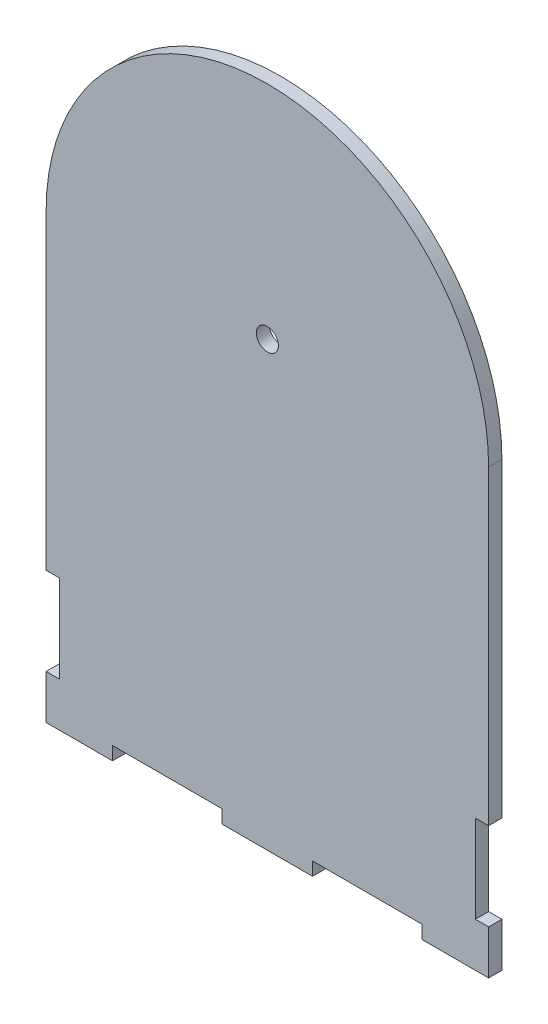
ISO-10303-21;
HEADER;
FILE_DESCRIPTION(('STEP AP214'),'2;1');
FILE_NAME('part.step','',(''),(''),'','','');
FILE_SCHEMA(('AUTOMOTIVE_DESIGN { 1 0 10303 214 1 1 1 1 }'));
ENDSEC;
DATA;
#1=APPLICATION_CONTEXT('core data for automotive mechanical design processes');
#2=APPLICATION_PROTOCOL_DEFINITION('international standard','automotive_design',2000,#1);
#3=PRODUCT_CONTEXT('',#1,'mechanical');
#4=PRODUCT('Part','Part','',(#3));
#5=PRODUCT_RELATED_PRODUCT_CATEGORY('part','',(#4));
#6=PRODUCT_DEFINITION_FORMATION('','',#4);
#7=PRODUCT_DEFINITION_CONTEXT('part definition',#1,'design');
#8=PRODUCT_DEFINITION('design','',#6,#7);
#9=PRODUCT_DEFINITION_SHAPE('','',#8);
#10=(LENGTH_UNIT() NAMED_UNIT(*) SI_UNIT(.MILLI.,.METRE.));
#11=(NAMED_UNIT(*) PLANE_ANGLE_UNIT() SI_UNIT($,.RADIAN.));
#12=(NAMED_UNIT(*) SI_UNIT($,.STERADIAN.) SOLID_ANGLE_UNIT());
#13=UNCERTAINTY_MEASURE_WITH_UNIT(LENGTH_MEASURE(1.E-05),#10,'distance_accuracy_value','');
#14=(GEOMETRIC_REPRESENTATION_CONTEXT(3) GLOBAL_UNCERTAINTY_ASSIGNED_CONTEXT((#13)) GLOBAL_UNIT_ASSIGNED_CONTEXT((#10,
#11,#12)) REPRESENTATION_CONTEXT('',''));
#15=CARTESIAN_POINT('',(0.,0.,0.));
#16=DIRECTION('',(0.,0.,1.));
#17=DIRECTION('',(1.,0.,0.));
#18=AXIS2_PLACEMENT_3D('',#15,#16,#17);
#19=CARTESIAN_POINT('',(50.,100.,3.));
#20=DIRECTION('',(0.,0.,-1.));
#21=DIRECTION('',(-1.,0.,0.));
#22=AXIS2_PLACEMENT_3D('',#19,#20,#21);
#23=CYLINDRICAL_SURFACE('',#22,50.);
#24=CARTESIAN_POINT('',(50.,100.,0.));
#25=DIRECTION('',(0.,0.,1.));
#26=DIRECTION('',(1.,0.,0.));
#27=AXIS2_PLACEMENT_3D('',#24,#25,#26);
#28=CIRCLE('',#27,50.);
#29=CARTESIAN_POINT('',(100.,100.,0.));
#30=VERTEX_POINT('',#29);
#31=CARTESIAN_POINT('',(0.,100.,0.));
#32=VERTEX_POINT('',#31);
#33=EDGE_CURVE('E206',#30,#32,#28,.T.);
#34=ORIENTED_EDGE('',*,*,#33,.T.);
#35=DIRECTION('',(0.,0.,-1.));
#36=VECTOR('',#35,1.);
#37=CARTESIAN_POINT('',(0.,100.,3.));
#38=LINE('',#37,#36);
#39=CARTESIAN_POINT('',(0.,100.,3.));
#40=VERTEX_POINT('',#39);
#41=EDGE_CURVE('E11',#40,#32,#38,.T.);
#42=ORIENTED_EDGE('',*,*,#41,.F.);
#43=CARTESIAN_POINT('',(50.,100.,3.));
#44=DIRECTION('',(0.,0.,1.));
#45=DIRECTION('',(1.,0.,0.));
#46=AXIS2_PLACEMENT_3D('',#43,#44,#45);
#47=CIRCLE('',#46,50.);
#48=CARTESIAN_POINT('',(100.,100.,3.));
#49=VERTEX_POINT('',#48);
#50=EDGE_CURVE('E125',#49,#40,#47,.T.);
#51=ORIENTED_EDGE('',*,*,#50,.F.);
#52=DIRECTION('',(0.,0.,-1.));
#53=VECTOR('',#52,1.);
#54=CARTESIAN_POINT('',(100.,100.,3.));
#55=LINE('',#54,#53);
#56=EDGE_CURVE('E198',#49,#30,#55,.T.);
#57=ORIENTED_EDGE('',*,*,#56,.T.);
#58=EDGE_LOOP('',(#34,#42,#51,#57));
#59=FACE_BOUND('',#58,.T.);
#60=ADVANCED_FACE('F36',(#59),#23,.T.);
#61=CARTESIAN_POINT('',(0.,0.,3.));
#62=DIRECTION('',(-1.,0.,0.));
#63=DIRECTION('',(0.,-1.,0.));
#64=AXIS2_PLACEMENT_3D('',#61,#62,#63);
#65=PLANE('',#64);
#66=DIRECTION('',(0.,1.,0.));
#67=VECTOR('',#66,1.);
#68=CARTESIAN_POINT('',(0.,0.,0.));
#69=LINE('',#68,#67);
#70=CARTESIAN_POINT('',(0.,29.8,0.));
#71=VERTEX_POINT('',#70);
#72=EDGE_CURVE('E209',#71,#32,#69,.T.);
#73=ORIENTED_EDGE('',*,*,#72,.F.);
#74=DIRECTION('',(0.,0.,-1.));
#75=VECTOR('',#74,1.);
#76=CARTESIAN_POINT('',(0.,29.8,3.));
#77=LINE('',#76,#75);
#78=CARTESIAN_POINT('',(0.,29.8,3.));
#79=VERTEX_POINT('',#78);
#80=EDGE_CURVE('E45',#79,#71,#77,.T.);
#81=ORIENTED_EDGE('',*,*,#80,.F.);
#82=DIRECTION('',(0.,1.,0.));
#83=VECTOR('',#82,1.);
#84=CARTESIAN_POINT('',(0.,0.,3.));
#85=LINE('',#84,#83);
#86=EDGE_CURVE('E301',#79,#40,#85,.T.);
#87=ORIENTED_EDGE('',*,*,#86,.T.);
#88=ORIENTED_EDGE('',*,*,#41,.T.);
#89=EDGE_LOOP('',(#73,#81,#87,#88));
#90=FACE_BOUND('',#89,.T.);
#91=ADVANCED_FACE('F300',(#90),#65,.T.);
#92=CARTESIAN_POINT('',(0.,29.8,3.));
#93=DIRECTION('',(0.,1.,0.));
#94=DIRECTION('',(0.,0.,1.));
#95=AXIS2_PLACEMENT_3D('',#92,#93,#94);
#96=PLANE('',#95);
#97=DIRECTION('',(1.,0.,0.));
#98=VECTOR('',#97,1.);
#99=CARTESIAN_POINT('',(0.,29.8,0.));
#100=LINE('',#99,#98);
#101=CARTESIAN_POINT('',(3.00000000000002,29.8,0.));
#102=VERTEX_POINT('',#101);
#103=EDGE_CURVE('E212',#71,#102,#100,.T.);
#104=ORIENTED_EDGE('',*,*,#103,.T.);
#105=DIRECTION('',(0.,0.,-1.));
#106=VECTOR('',#105,1.);
#107=CARTESIAN_POINT('',(3.00000000000002,29.8,3.));
#108=LINE('',#107,#106);
#109=CARTESIAN_POINT('',(3.00000000000002,29.8,3.));
#110=VERTEX_POINT('',#109);
#111=EDGE_CURVE('E285',#110,#102,#108,.T.);
#112=ORIENTED_EDGE('',*,*,#111,.F.);
#113=DIRECTION('',(1.,0.,0.));
#114=VECTOR('',#113,1.);
#115=CARTESIAN_POINT('',(0.,29.8,3.));
#116=LINE('',#115,#114);
#117=EDGE_CURVE('E292',#79,#110,#116,.T.);
#118=ORIENTED_EDGE('',*,*,#117,.F.);
#119=ORIENTED_EDGE('',*,*,#80,.T.);
#120=EDGE_LOOP('',(#104,#112,#118,#119));
#121=FACE_BOUND('',#120,.T.);
#122=ADVANCED_FACE('F290',(#121),#96,.F.);
#123=CARTESIAN_POINT('',(3.00000000000091,0.,3.));
#124=DIRECTION('',(1.,0.,0.));
#125=DIRECTION('',(0.,1.,0.));
#126=AXIS2_PLACEMENT_3D('',#123,#124,#125);
#127=PLANE('',#126);
#128=DIRECTION('',(0.,-1.,0.));
#129=VECTOR('',#128,1.);
#130=CARTESIAN_POINT('',(3.00000000000091,0.,0.));
#131=LINE('',#130,#129);
#132=CARTESIAN_POINT('',(3.00000000000061,9.99999999999978,0.));
#133=VERTEX_POINT('',#132);
#134=EDGE_CURVE('E215',#102,#133,#131,.T.);
#135=ORIENTED_EDGE('',*,*,#134,.T.);
#136=DIRECTION('',(0.,0.,-1.));
#137=VECTOR('',#136,1.);
#138=CARTESIAN_POINT('',(3.00000000000061,9.99999999999978,3.));
#139=LINE('',#138,#137);
#140=CARTESIAN_POINT('',(3.00000000000061,9.99999999999978,3.));
#141=VERTEX_POINT('',#140);
#142=EDGE_CURVE('E283',#141,#133,#139,.T.);
#143=ORIENTED_EDGE('',*,*,#142,.F.);
#144=DIRECTION('',(0.,-1.,0.));
#145=VECTOR('',#144,1.);
#146=CARTESIAN_POINT('',(3.00000000000091,0.,3.));
#147=LINE('',#146,#145);
#148=EDGE_CURVE('E313',#110,#141,#147,.T.);
#149=ORIENTED_EDGE('',*,*,#148,.F.);
#150=ORIENTED_EDGE('',*,*,#111,.T.);
#151=EDGE_LOOP('',(#135,#143,#149,#150));
#152=FACE_BOUND('',#151,.T.);
#153=ADVANCED_FACE('F400',(#152),#127,.F.);
#154=CARTESIAN_POINT('',(-7.40148683083404E-13,9.99999999999956,3.));
#155=DIRECTION('',(0.,1.,0.));
#156=DIRECTION('',(-1.,0.,0.));
#157=AXIS2_PLACEMENT_3D('',#154,#155,#156);
#158=PLANE('',#157);
#159=DIRECTION('',(1.,0.,0.));
#160=VECTOR('',#159,1.);
#161=CARTESIAN_POINT('',(-7.40148683083404E-13,9.99999999999956,0.));
#162=LINE('',#161,#160);
#163=CARTESIAN_POINT('',(0.,9.99999999999967,0.));
#164=VERTEX_POINT('',#163);
#165=EDGE_CURVE('E218',#164,#133,#162,.T.);
#166=ORIENTED_EDGE('',*,*,#165,.F.);
#167=DIRECTION('',(0.,0.,-1.));
#168=VECTOR('',#167,1.);
#169=CARTESIAN_POINT('',(0.,9.99999999999967,3.));
#170=LINE('',#169,#168);
#171=CARTESIAN_POINT('',(0.,9.99999999999967,3.));
#172=VERTEX_POINT('',#171);
#173=EDGE_CURVE('E281',#172,#164,#170,.T.);
#174=ORIENTED_EDGE('',*,*,#173,.F.);
#175=DIRECTION('',(1.,0.,0.));
#176=VECTOR('',#175,1.);
#177=CARTESIAN_POINT('',(-7.40148683083404E-13,9.99999999999956,3.));
#178=LINE('',#177,#176);
#179=EDGE_CURVE('E315',#172,#141,#178,.T.);
#180=ORIENTED_EDGE('',*,*,#179,.T.);
#181=ORIENTED_EDGE('',*,*,#142,.T.);
#182=EDGE_LOOP('',(#166,#174,#180,#181));
#183=FACE_BOUND('',#182,.T.);
#184=ADVANCED_FACE('F396',(#183),#158,.T.);
#185=CARTESIAN_POINT('',(0.,0.,0.));
#186=VERTEX_POINT('',#185);
#187=EDGE_CURVE('E213',#186,#164,#69,.T.);
#188=ORIENTED_EDGE('',*,*,#187,.F.);
#189=DIRECTION('',(0.,0.,-1.));
#190=VECTOR('',#189,1.);
#191=CARTESIAN_POINT('',(0.,0.,3.));
#192=LINE('',#191,#190);
#193=CARTESIAN_POINT('',(0.,0.,3.));
#194=VERTEX_POINT('',#193);
#195=EDGE_CURVE('E279',#194,#186,#192,.T.);
#196=ORIENTED_EDGE('',*,*,#195,.F.);
#197=EDGE_CURVE('E311',#194,#172,#85,.T.);
#198=ORIENTED_EDGE('',*,*,#197,.T.);
#199=ORIENTED_EDGE('',*,*,#173,.T.);
#200=EDGE_LOOP('',(#188,#196,#198,#199));
#201=FACE_BOUND('',#200,.T.);
#202=ADVANCED_FACE('F391',(#201),#65,.T.);
#203=CARTESIAN_POINT('',(0.,0.,3.));
#204=DIRECTION('',(0.,1.,0.));
#205=DIRECTION('',(0.,0.,1.));
#206=AXIS2_PLACEMENT_3D('',#203,#204,#205);
#207=PLANE('',#206);
#208=DIRECTION('',(1.,0.,0.));
#209=VECTOR('',#208,1.);
#210=CARTESIAN_POINT('',(0.,0.,0.));
#211=LINE('',#210,#209);
#212=CARTESIAN_POINT('',(15.,0.,0.));
#213=VERTEX_POINT('',#212);
#214=EDGE_CURVE('E221',#186,#213,#211,.T.);
#215=ORIENTED_EDGE('',*,*,#214,.T.);
#216=DIRECTION('',(0.,0.,-1.));
#217=VECTOR('',#216,1.);
#218=CARTESIAN_POINT('',(15.,0.,3.));
#219=LINE('',#218,#217);
#220=CARTESIAN_POINT('',(15.,0.,3.));
#221=VERTEX_POINT('',#220);
#222=EDGE_CURVE('E276',#221,#213,#219,.T.);
#223=ORIENTED_EDGE('',*,*,#222,.F.);
#224=DIRECTION('',(1.,0.,0.));
#225=VECTOR('',#224,1.);
#226=CARTESIAN_POINT('',(0.,0.,3.));
#227=LINE('',#226,#225);
#228=EDGE_CURVE('E318',#194,#221,#227,.T.);
#229=ORIENTED_EDGE('',*,*,#228,.F.);
#230=ORIENTED_EDGE('',*,*,#195,.T.);
#231=EDGE_LOOP('',(#215,#223,#229,#230));
#232=FACE_BOUND('',#231,.T.);
#233=ADVANCED_FACE('F386',(#232),#207,.F.);
#234=CARTESIAN_POINT('',(15.,0.,3.));
#235=DIRECTION('',(-1.,0.,0.));
#236=DIRECTION('',(0.,0.,1.));
#237=AXIS2_PLACEMENT_3D('',#234,#235,#236);
#238=PLANE('',#237);
#239=DIRECTION('',(0.,1.,0.));
#240=VECTOR('',#239,1.);
#241=CARTESIAN_POINT('',(15.,0.,0.));
#242=LINE('',#241,#240);
#243=CARTESIAN_POINT('',(15.,3.,0.));
#244=VERTEX_POINT('',#243);
#245=EDGE_CURVE('E223',#213,#244,#242,.T.);
#246=ORIENTED_EDGE('',*,*,#245,.T.);
#247=DIRECTION('',(0.,0.,-1.));
#248=VECTOR('',#247,1.);
#249=CARTESIAN_POINT('',(15.,3.,3.));
#250=LINE('',#249,#248);
#251=CARTESIAN_POINT('',(15.,3.,3.));
#252=VERTEX_POINT('',#251);
#253=EDGE_CURVE('E273',#252,#244,#250,.T.);
#254=ORIENTED_EDGE('',*,*,#253,.F.);
#255=DIRECTION('',(0.,1.,0.));
#256=VECTOR('',#255,1.);
#257=CARTESIAN_POINT('',(15.,0.,3.));
#258=LINE('',#257,#256);
#259=EDGE_CURVE('E320',#221,#252,#258,.T.);
#260=ORIENTED_EDGE('',*,*,#259,.F.);
#261=ORIENTED_EDGE('',*,*,#222,.T.);
#262=EDGE_LOOP('',(#246,#254,#260,#261));
#263=FACE_BOUND('',#262,.T.);
#264=ADVANCED_FACE('F382',(#263),#238,.F.);
#265=CARTESIAN_POINT('',(0.,3.,3.));
#266=DIRECTION('',(0.,1.,0.));
#267=DIRECTION('',(0.,0.,1.));
#268=AXIS2_PLACEMENT_3D('',#265,#266,#267);
#269=PLANE('',#268);
#270=DIRECTION('',(1.,0.,0.));
#271=VECTOR('',#270,1.);
#272=CARTESIAN_POINT('',(0.,3.,0.));
#273=LINE('',#272,#271);
#274=CARTESIAN_POINT('',(39.8,3.,0.));
#275=VERTEX_POINT('',#274);
#276=EDGE_CURVE('E225',#244,#275,#273,.T.);
#277=ORIENTED_EDGE('',*,*,#276,.T.);
#278=DIRECTION('',(0.,0.,-1.));
#279=VECTOR('',#278,1.);
#280=CARTESIAN_POINT('',(39.8,3.,3.));
#281=LINE('',#280,#279);
#282=CARTESIAN_POINT('',(39.8,3.,3.));
#283=VERTEX_POINT('',#282);
#284=EDGE_CURVE('E271',#283,#275,#281,.T.);
#285=ORIENTED_EDGE('',*,*,#284,.F.);
#286=DIRECTION('',(1.,0.,0.));
#287=VECTOR('',#286,1.);
#288=CARTESIAN_POINT('',(0.,3.,3.));
#289=LINE('',#288,#287);
#290=EDGE_CURVE('E322',#252,#283,#289,.T.);
#291=ORIENTED_EDGE('',*,*,#290,.F.);
#292=ORIENTED_EDGE('',*,*,#253,.T.);
#293=EDGE_LOOP('',(#277,#285,#291,#292));
#294=FACE_BOUND('',#293,.T.);
#295=ADVANCED_FACE('F377',(#294),#269,.F.);
#296=CARTESIAN_POINT('',(39.8,0.,3.));
#297=DIRECTION('',(-1.,0.,0.));
#298=DIRECTION('',(0.,0.,1.));
#299=AXIS2_PLACEMENT_3D('',#296,#297,#298);
#300=PLANE('',#299);
#301=DIRECTION('',(0.,1.,0.));
#302=VECTOR('',#301,1.);
#303=CARTESIAN_POINT('',(39.8,0.,0.));
#304=LINE('',#303,#302);
#305=CARTESIAN_POINT('',(39.8,0.,0.));
#306=VERTEX_POINT('',#305);
#307=EDGE_CURVE('E228',#306,#275,#304,.T.);
#308=ORIENTED_EDGE('',*,*,#307,.F.);
#309=DIRECTION('',(0.,0.,-1.));
#310=VECTOR('',#309,1.);
#311=CARTESIAN_POINT('',(39.8,0.,3.));
#312=LINE('',#311,#310);
#313=CARTESIAN_POINT('',(39.8,0.,3.));
#314=VERTEX_POINT('',#313);
#315=EDGE_CURVE('E269',#314,#306,#312,.T.);
#316=ORIENTED_EDGE('',*,*,#315,.F.);
#317=DIRECTION('',(0.,1.,0.));
#318=VECTOR('',#317,1.);
#319=CARTESIAN_POINT('',(39.8,0.,3.));
#320=LINE('',#319,#318);
#321=EDGE_CURVE('E324',#314,#283,#320,.T.);
#322=ORIENTED_EDGE('',*,*,#321,.T.);
#323=ORIENTED_EDGE('',*,*,#284,.T.);
#324=EDGE_LOOP('',(#308,#316,#322,#323));
#325=FACE_BOUND('',#324,.T.);
#326=ADVANCED_FACE('F371',(#325),#300,.T.);
#327=CARTESIAN_POINT('',(0.,0.,3.));
#328=DIRECTION('',(0.,1.,0.));
#329=DIRECTION('',(0.,0.,1.));
#330=AXIS2_PLACEMENT_3D('',#327,#328,#329);
#331=PLANE('',#330);
#332=DIRECTION('',(1.,0.,0.));
#333=VECTOR('',#332,1.);
#334=CARTESIAN_POINT('',(0.,0.,0.));
#335=LINE('',#334,#333);
#336=CARTESIAN_POINT('',(60.2,0.,0.));
#337=VERTEX_POINT('',#336);
#338=EDGE_CURVE('E231',#306,#337,#335,.T.);
#339=ORIENTED_EDGE('',*,*,#338,.T.);
#340=DIRECTION('',(0.,0.,-1.));
#341=VECTOR('',#340,1.);
#342=CARTESIAN_POINT('',(60.2,0.,3.));
#343=LINE('',#342,#341);
#344=CARTESIAN_POINT('',(60.2,0.,3.));
#345=VERTEX_POINT('',#344);
#346=EDGE_CURVE('E266',#345,#337,#343,.T.);
#347=ORIENTED_EDGE('',*,*,#346,.F.);
#348=DIRECTION('',(1.,0.,0.));
#349=VECTOR('',#348,1.);
#350=CARTESIAN_POINT('',(0.,0.,3.));
#351=LINE('',#350,#349);
#352=EDGE_CURVE('E327',#314,#345,#351,.T.);
#353=ORIENTED_EDGE('',*,*,#352,.F.);
#354=ORIENTED_EDGE('',*,*,#315,.T.);
#355=EDGE_LOOP('',(#339,#347,#353,#354));
#356=FACE_BOUND('',#355,.T.);
#357=ADVANCED_FACE('F368',(#356),#331,.F.);
#358=CARTESIAN_POINT('',(60.2,0.,3.));
#359=DIRECTION('',(-1.,0.,0.));
#360=DIRECTION('',(0.,0.,1.));
#361=AXIS2_PLACEMENT_3D('',#358,#359,#360);
#362=PLANE('',#361);
#363=DIRECTION('',(0.,1.,0.));
#364=VECTOR('',#363,1.);
#365=CARTESIAN_POINT('',(60.2,0.,0.));
#366=LINE('',#365,#364);
#367=CARTESIAN_POINT('',(60.2,3.,0.));
#368=VERTEX_POINT('',#367);
#369=EDGE_CURVE('E233',#337,#368,#366,.T.);
#370=ORIENTED_EDGE('',*,*,#369,.T.);
#371=DIRECTION('',(0.,0.,-1.));
#372=VECTOR('',#371,1.);
#373=CARTESIAN_POINT('',(60.2,3.,3.));
#374=LINE('',#373,#372);
#375=CARTESIAN_POINT('',(60.2,3.,3.));
#376=VERTEX_POINT('',#375);
#377=EDGE_CURVE('E263',#376,#368,#374,.T.);
#378=ORIENTED_EDGE('',*,*,#377,.F.);
#379=DIRECTION('',(0.,1.,0.));
#380=VECTOR('',#379,1.);
#381=CARTESIAN_POINT('',(60.2,0.,3.));
#382=LINE('',#381,#380);
#383=EDGE_CURVE('E329',#345,#376,#382,.T.);
#384=ORIENTED_EDGE('',*,*,#383,.F.);
#385=ORIENTED_EDGE('',*,*,#346,.T.);
#386=EDGE_LOOP('',(#370,#378,#384,#385));
#387=FACE_BOUND('',#386,.T.);
#388=ADVANCED_FACE('F363',(#387),#362,.F.);
#389=CARTESIAN_POINT('',(0.,3.,3.));
#390=DIRECTION('',(0.,1.,0.));
#391=DIRECTION('',(0.,0.,1.));
#392=AXIS2_PLACEMENT_3D('',#389,#390,#391);
#393=PLANE('',#392);
#394=DIRECTION('',(1.,0.,0.));
#395=VECTOR('',#394,1.);
#396=CARTESIAN_POINT('',(0.,3.,0.));
#397=LINE('',#396,#395);
#398=CARTESIAN_POINT('',(85.,3.,0.));
#399=VERTEX_POINT('',#398);
#400=EDGE_CURVE('E236',#368,#399,#397,.T.);
#401=ORIENTED_EDGE('',*,*,#400,.T.);
#402=DIRECTION('',(0.,0.,-1.));
#403=VECTOR('',#402,1.);
#404=CARTESIAN_POINT('',(85.,3.,3.));
#405=LINE('',#404,#403);
#406=CARTESIAN_POINT('',(85.,3.,3.));
#407=VERTEX_POINT('',#406);
#408=EDGE_CURVE('E261',#407,#399,#405,.T.);
#409=ORIENTED_EDGE('',*,*,#408,.F.);
#410=DIRECTION('',(1.,0.,0.));
#411=VECTOR('',#410,1.);
#412=CARTESIAN_POINT('',(0.,3.,3.));
#413=LINE('',#412,#411);
#414=EDGE_CURVE('E332',#376,#407,#413,.T.);
#415=ORIENTED_EDGE('',*,*,#414,.F.);
#416=ORIENTED_EDGE('',*,*,#377,.T.);
#417=EDGE_LOOP('',(#401,#409,#415,#416));
#418=FACE_BOUND('',#417,.T.);
#419=ADVANCED_FACE('F357',(#418),#393,.F.);
#420=CARTESIAN_POINT('',(85.,0.,3.));
#421=DIRECTION('',(-1.,0.,0.));
#422=DIRECTION('',(0.,0.,1.));
#423=AXIS2_PLACEMENT_3D('',#420,#421,#422);
#424=PLANE('',#423);
#425=DIRECTION('',(0.,1.,0.));
#426=VECTOR('',#425,1.);
#427=CARTESIAN_POINT('',(85.,0.,0.));
#428=LINE('',#427,#426);
#429=CARTESIAN_POINT('',(85.,0.,0.));
#430=VERTEX_POINT('',#429);
#431=EDGE_CURVE('E239',#430,#399,#428,.T.);
#432=ORIENTED_EDGE('',*,*,#431,.F.);
#433=DIRECTION('',(0.,0.,-1.));
#434=VECTOR('',#433,1.);
#435=CARTESIAN_POINT('',(85.,0.,3.));
#436=LINE('',#435,#434);
#437=CARTESIAN_POINT('',(85.,0.,3.));
#438=VERTEX_POINT('',#437);
#439=EDGE_CURVE('E259',#438,#430,#436,.T.);
#440=ORIENTED_EDGE('',*,*,#439,.F.);
#441=DIRECTION('',(0.,1.,0.));
#442=VECTOR('',#441,1.);
#443=CARTESIAN_POINT('',(85.,0.,3.));
#444=LINE('',#443,#442);
#445=EDGE_CURVE('E334',#438,#407,#444,.T.);
#446=ORIENTED_EDGE('',*,*,#445,.T.);
#447=ORIENTED_EDGE('',*,*,#408,.T.);
#448=EDGE_LOOP('',(#432,#440,#446,#447));
#449=FACE_BOUND('',#448,.T.);
#450=ADVANCED_FACE('F353',(#449),#424,.T.);
#451=CARTESIAN_POINT('',(100.,0.,0.));
#452=VERTEX_POINT('',#451);
#453=EDGE_CURVE('E234',#430,#452,#335,.T.);
#454=ORIENTED_EDGE('',*,*,#453,.T.);
#455=DIRECTION('',(0.,0.,-1.));
#456=VECTOR('',#455,1.);
#457=CARTESIAN_POINT('',(100.,0.,3.));
#458=LINE('',#457,#456);
#459=CARTESIAN_POINT('',(100.,0.,3.));
#460=VERTEX_POINT('',#459);
#461=EDGE_CURVE('E256',#460,#452,#458,.T.);
#462=ORIENTED_EDGE('',*,*,#461,.F.);
#463=EDGE_CURVE('E330',#438,#460,#351,.T.);
#464=ORIENTED_EDGE('',*,*,#463,.F.);
#465=ORIENTED_EDGE('',*,*,#439,.T.);
#466=EDGE_LOOP('',(#454,#462,#464,#465));
#467=FACE_BOUND('',#466,.T.);
#468=ADVANCED_FACE('F342',(#467),#331,.F.);
#469=CARTESIAN_POINT('',(100.,0.,3.));
#470=DIRECTION('',(-1.,0.,0.));
#471=DIRECTION('',(0.,-1.,0.));
#472=AXIS2_PLACEMENT_3D('',#469,#470,#471);
#473=PLANE('',#472);
#474=DIRECTION('',(0.,1.,0.));
#475=VECTOR('',#474,1.);
#476=CARTESIAN_POINT('',(100.,0.,0.));
#477=LINE('',#476,#475);
#478=CARTESIAN_POINT('',(100.,10.,0.));
#479=VERTEX_POINT('',#478);
#480=EDGE_CURVE('E242',#452,#479,#477,.T.);
#481=ORIENTED_EDGE('',*,*,#480,.T.);
#482=DIRECTION('',(0.,0.,-1.));
#483=VECTOR('',#482,1.);
#484=CARTESIAN_POINT('',(100.,10.,3.));
#485=LINE('',#484,#483);
#486=CARTESIAN_POINT('',(100.,10.,3.));
#487=VERTEX_POINT('',#486);
#488=EDGE_CURVE('E253',#487,#479,#485,.T.);
#489=ORIENTED_EDGE('',*,*,#488,.F.);
#490=DIRECTION('',(0.,1.,0.));
#491=VECTOR('',#490,1.);
#492=CARTESIAN_POINT('',(100.,0.,3.));
#493=LINE('',#492,#491);
#494=EDGE_CURVE('E200',#460,#487,#493,.T.);
#495=ORIENTED_EDGE('',*,*,#494,.F.);
#496=ORIENTED_EDGE('',*,*,#461,.T.);
#497=EDGE_LOOP('',(#481,#489,#495,#496));
#498=FACE_BOUND('',#497,.T.);
#499=ADVANCED_FACE('F346',(#498),#473,.F.);
#500=CARTESIAN_POINT('',(0.,10.,3.));
#501=DIRECTION('',(0.,-1.,0.));
#502=DIRECTION('',(0.,0.,-1.));
#503=AXIS2_PLACEMENT_3D('',#500,#501,#502);
#504=PLANE('',#503);
#505=DIRECTION('',(-1.,0.,0.));
#506=VECTOR('',#505,1.);
#507=CARTESIAN_POINT('',(0.,10.,0.));
#508=LINE('',#507,#506);
#509=CARTESIAN_POINT('',(97.,10.,0.));
#510=VERTEX_POINT('',#509);
#511=EDGE_CURVE('E244',#479,#510,#508,.T.);
#512=ORIENTED_EDGE('',*,*,#511,.T.);
#513=DIRECTION('',(0.,0.,-1.));
#514=VECTOR('',#513,1.);
#515=CARTESIAN_POINT('',(97.,10.,3.));
#516=LINE('',#515,#514);
#517=CARTESIAN_POINT('',(97.,10.,3.));
#518=VERTEX_POINT('',#517);
#519=EDGE_CURVE('E188',#518,#510,#516,.T.);
#520=ORIENTED_EDGE('',*,*,#519,.F.);
#521=DIRECTION('',(-1.,0.,0.));
#522=VECTOR('',#521,1.);
#523=CARTESIAN_POINT('',(0.,10.,3.));
#524=LINE('',#523,#522);
#525=EDGE_CURVE('E193',#487,#518,#524,.T.);
#526=ORIENTED_EDGE('',*,*,#525,.F.);
#527=ORIENTED_EDGE('',*,*,#488,.T.);
#528=EDGE_LOOP('',(#512,#520,#526,#527));
#529=FACE_BOUND('',#528,.T.);
#530=ADVANCED_FACE('F349',(#529),#504,.F.);
#531=CARTESIAN_POINT('',(97.,0.,3.));
#532=DIRECTION('',(1.,0.,0.));
#533=DIRECTION('',(0.,0.,-1.));
#534=AXIS2_PLACEMENT_3D('',#531,#532,#533);
#535=PLANE('',#534);
#536=DIRECTION('',(0.,-1.,0.));
#537=VECTOR('',#536,1.);
#538=CARTESIAN_POINT('',(97.,0.,0.));
#539=LINE('',#538,#537);
#540=CARTESIAN_POINT('',(97.,29.8,0.));
#541=VERTEX_POINT('',#540);
#542=EDGE_CURVE('E183',#541,#510,#539,.T.);
#543=ORIENTED_EDGE('',*,*,#542,.F.);
#544=DIRECTION('',(0.,0.,-1.));
#545=VECTOR('',#544,1.);
#546=CARTESIAN_POINT('',(97.,29.8,3.));
#547=LINE('',#546,#545);
#548=CARTESIAN_POINT('',(97.,29.8,3.));
#549=VERTEX_POINT('',#548);
#550=EDGE_CURVE('E178',#549,#541,#547,.T.);
#551=ORIENTED_EDGE('',*,*,#550,.F.);
#552=DIRECTION('',(0.,-1.,0.));
#553=VECTOR('',#552,1.);
#554=CARTESIAN_POINT('',(97.,0.,3.));
#555=LINE('',#554,#553);
#556=EDGE_CURVE('E181',#549,#518,#555,.T.);
#557=ORIENTED_EDGE('',*,*,#556,.T.);
#558=ORIENTED_EDGE('',*,*,#519,.T.);
#559=EDGE_LOOP('',(#543,#551,#557,#558));
#560=FACE_BOUND('',#559,.T.);
#561=ADVANCED_FACE('F180',(#560),#535,.T.);
#562=CARTESIAN_POINT('',(0.,29.8,3.));
#563=DIRECTION('',(0.,-1.,0.));
#564=DIRECTION('',(0.,0.,-1.));
#565=AXIS2_PLACEMENT_3D('',#562,#563,#564);
#566=PLANE('',#565);
#567=DIRECTION('',(-1.,0.,0.));
#568=VECTOR('',#567,1.);
#569=CARTESIAN_POINT('',(0.,29.8,0.));
#570=LINE('',#569,#568);
#571=CARTESIAN_POINT('',(100.,29.8,0.));
#572=VERTEX_POINT('',#571);
#573=EDGE_CURVE('E248',#572,#541,#570,.T.);
#574=ORIENTED_EDGE('',*,*,#573,.F.);
#575=DIRECTION('',(0.,0.,-1.));
#576=VECTOR('',#575,1.);
#577=CARTESIAN_POINT('',(100.,29.8,3.));
#578=LINE('',#577,#576);
#579=CARTESIAN_POINT('',(100.,29.8,3.));
#580=VERTEX_POINT('',#579);
#581=EDGE_CURVE('E116',#580,#572,#578,.T.);
#582=ORIENTED_EDGE('',*,*,#581,.F.);
#583=DIRECTION('',(-1.,0.,0.));
#584=VECTOR('',#583,1.);
#585=CARTESIAN_POINT('',(0.,29.8,3.));
#586=LINE('',#585,#584);
#587=EDGE_CURVE('E191',#580,#549,#586,.T.);
#588=ORIENTED_EDGE('',*,*,#587,.T.);
#589=ORIENTED_EDGE('',*,*,#550,.T.);
#590=EDGE_LOOP('',(#574,#582,#588,#589));
#591=FACE_BOUND('',#590,.T.);
#592=ADVANCED_FACE('F196',(#591),#566,.T.);
#593=CARTESIAN_POINT('',(50.,100.,3.));
#594=DIRECTION('',(0.,0.,-1.));
#595=DIRECTION('',(-1.,0.,0.));
#596=AXIS2_PLACEMENT_3D('',#593,#594,#595);
#597=CYLINDRICAL_SURFACE('',#596,2.5);
#598=CARTESIAN_POINT('',(50.,100.,3.));
#599=DIRECTION('',(0.,0.,1.));
#600=DIRECTION('',(1.,0.,0.));
#601=AXIS2_PLACEMENT_3D('',#598,#599,#600);
#602=CIRCLE('',#601,2.5);
#603=CARTESIAN_POINT('',(52.5,100.,3.));
#604=VERTEX_POINT('',#603);
#605=EDGE_CURVE('E303',#604,#604,#602,.T.);
#606=ORIENTED_EDGE('',*,*,#605,.T.);
#607=EDGE_LOOP('',(#606));
#608=FACE_BOUND('',#607,.T.);
#609=CARTESIAN_POINT('',(50.,100.,0.));
#610=DIRECTION('',(0.,0.,1.));
#611=DIRECTION('',(1.,0.,0.));
#612=AXIS2_PLACEMENT_3D('',#609,#610,#611);
#613=CIRCLE('',#612,2.5);
#614=CARTESIAN_POINT('',(52.5,100.,0.));
#615=VERTEX_POINT('',#614);
#616=EDGE_CURVE('E203',#615,#615,#613,.T.);
#617=ORIENTED_EDGE('',*,*,#616,.F.);
#618=EDGE_LOOP('',(#617));
#619=FACE_BOUND('',#618,.T.);
#620=ADVANCED_FACE('F38',(#608,#619),#597,.F.);
#621=EDGE_CURVE('E119',#572,#30,#477,.T.);
#622=ORIENTED_EDGE('',*,*,#621,.T.);
#623=ORIENTED_EDGE('',*,*,#56,.F.);
#624=EDGE_CURVE('E53',#580,#49,#493,.T.);
#625=ORIENTED_EDGE('',*,*,#624,.F.);
#626=ORIENTED_EDGE('',*,*,#581,.T.);
#627=EDGE_LOOP('',(#622,#623,#625,#626));
#628=FACE_BOUND('',#627,.T.);
#629=ADVANCED_FACE('F444',(#628),#473,.F.);
#630=CARTESIAN_POINT('',(0.,0.,3.));
#631=DIRECTION('',(0.,0.,1.));
#632=DIRECTION('',(1.,0.,0.));
#633=AXIS2_PLACEMENT_3D('',#630,#631,#632);
#634=PLANE('',#633);
#635=ORIENTED_EDGE('',*,*,#605,.F.);
#636=EDGE_LOOP('',(#635));
#637=FACE_BOUND('',#636,.T.);
#638=ORIENTED_EDGE('',*,*,#50,.T.);
#639=ORIENTED_EDGE('',*,*,#86,.F.);
#640=ORIENTED_EDGE('',*,*,#117,.T.);
#641=ORIENTED_EDGE('',*,*,#148,.T.);
#642=ORIENTED_EDGE('',*,*,#179,.F.);
#643=ORIENTED_EDGE('',*,*,#197,.F.);
#644=ORIENTED_EDGE('',*,*,#228,.T.);
#645=ORIENTED_EDGE('',*,*,#259,.T.);
#646=ORIENTED_EDGE('',*,*,#290,.T.);
#647=ORIENTED_EDGE('',*,*,#321,.F.);
#648=ORIENTED_EDGE('',*,*,#352,.T.);
#649=ORIENTED_EDGE('',*,*,#383,.T.);
#650=ORIENTED_EDGE('',*,*,#414,.T.);
#651=ORIENTED_EDGE('',*,*,#445,.F.);
#652=ORIENTED_EDGE('',*,*,#463,.T.);
#653=ORIENTED_EDGE('',*,*,#494,.T.);
#654=ORIENTED_EDGE('',*,*,#525,.T.);
#655=ORIENTED_EDGE('',*,*,#556,.F.);
#656=ORIENTED_EDGE('',*,*,#587,.F.);
#657=ORIENTED_EDGE('',*,*,#624,.T.);
#658=EDGE_LOOP('',(#638,#639,#640,#641,#642,#643,#644,#645,#646,#647,#648,#649,#650,#651,#652,
#653,#654,#655,#656,#657));
#659=FACE_BOUND('',#658,.T.);
#660=ADVANCED_FACE('F190',(#637,#659),#634,.T.);
#661=CARTESIAN_POINT('',(0.,0.,0.));
#662=DIRECTION('',(0.,0.,1.));
#663=DIRECTION('',(1.,0.,0.));
#664=AXIS2_PLACEMENT_3D('',#661,#662,#663);
#665=PLANE('',#664);
#666=ORIENTED_EDGE('',*,*,#616,.T.);
#667=EDGE_LOOP('',(#666));
#668=FACE_BOUND('',#667,.T.);
#669=ORIENTED_EDGE('',*,*,#33,.F.);
#670=ORIENTED_EDGE('',*,*,#621,.F.);
#671=ORIENTED_EDGE('',*,*,#573,.T.);
#672=ORIENTED_EDGE('',*,*,#542,.T.);
#673=ORIENTED_EDGE('',*,*,#511,.F.);
#674=ORIENTED_EDGE('',*,*,#480,.F.);
#675=ORIENTED_EDGE('',*,*,#453,.F.);
#676=ORIENTED_EDGE('',*,*,#431,.T.);
#677=ORIENTED_EDGE('',*,*,#400,.F.);
#678=ORIENTED_EDGE('',*,*,#369,.F.);
#679=ORIENTED_EDGE('',*,*,#338,.F.);
#680=ORIENTED_EDGE('',*,*,#307,.T.);
#681=ORIENTED_EDGE('',*,*,#276,.F.);
#682=ORIENTED_EDGE('',*,*,#245,.F.);
#683=ORIENTED_EDGE('',*,*,#214,.F.);
#684=ORIENTED_EDGE('',*,*,#187,.T.);
#685=ORIENTED_EDGE('',*,*,#165,.T.);
#686=ORIENTED_EDGE('',*,*,#134,.F.);
#687=ORIENTED_EDGE('',*,*,#103,.F.);
#688=ORIENTED_EDGE('',*,*,#72,.T.);
#689=EDGE_LOOP('',(#669,#670,#671,#672,#673,#674,#675,#676,#677,#678,#679,#680,#681,#682,#683,
#684,#685,#686,#687,#688));
#690=FACE_BOUND('',#689,.T.);
#691=ADVANCED_FACE('F299',(#668,#690),#665,.F.);
#692=CLOSED_SHELL('',(#60,#91,#122,#153,#184,#202,#233,#264,#295,#326,#357,#388,#419,#450,#468,
#499,#530,#561,#592,#620,#629,#660,#691));
#693=MANIFOLD_SOLID_BREP('B2',#692);
#694=ADVANCED_BREP_SHAPE_REPRESENTATION('',(#18,#693),#14);
#695=SHAPE_DEFINITION_REPRESENTATION(#9,#694);
ENDSEC;
END-ISO-10303-21;
